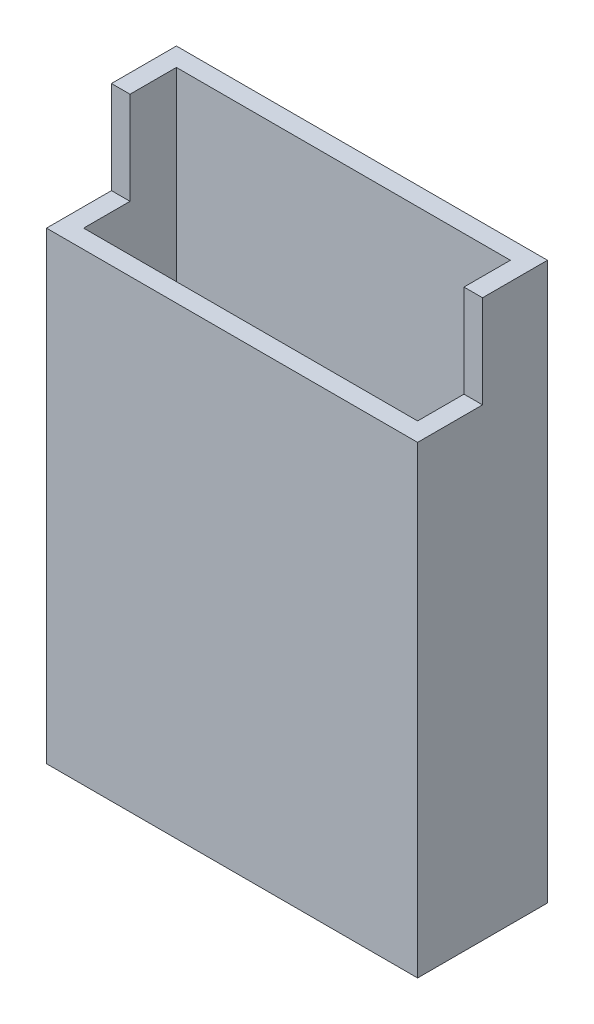
ISO-10303-21;
HEADER;
FILE_DESCRIPTION(('STEP AP214'),'2;1');
FILE_NAME('part.step','',(''),(''),'','','');
FILE_SCHEMA(('AUTOMOTIVE_DESIGN { 1 0 10303 214 1 1 1 1 }'));
ENDSEC;
DATA;
#1=APPLICATION_CONTEXT('core data for automotive mechanical design processes');
#2=APPLICATION_PROTOCOL_DEFINITION('international standard','automotive_design',2000,#1);
#3=PRODUCT_CONTEXT('',#1,'mechanical');
#4=PRODUCT('Part','Part','',(#3));
#5=PRODUCT_RELATED_PRODUCT_CATEGORY('part','',(#4));
#6=PRODUCT_DEFINITION_FORMATION('','',#4);
#7=PRODUCT_DEFINITION_CONTEXT('part definition',#1,'design');
#8=PRODUCT_DEFINITION('design','',#6,#7);
#9=PRODUCT_DEFINITION_SHAPE('','',#8);
#10=(LENGTH_UNIT() NAMED_UNIT(*) SI_UNIT(.MILLI.,.METRE.));
#11=(NAMED_UNIT(*) PLANE_ANGLE_UNIT() SI_UNIT($,.RADIAN.));
#12=(NAMED_UNIT(*) SI_UNIT($,.STERADIAN.) SOLID_ANGLE_UNIT());
#13=UNCERTAINTY_MEASURE_WITH_UNIT(LENGTH_MEASURE(1.E-05),#10,'distance_accuracy_value','');
#14=(GEOMETRIC_REPRESENTATION_CONTEXT(3) GLOBAL_UNCERTAINTY_ASSIGNED_CONTEXT((#13)) GLOBAL_UNIT_ASSIGNED_CONTEXT((#10,
#11,#12)) REPRESENTATION_CONTEXT('',''));
#15=CARTESIAN_POINT('',(0.,0.,0.));
#16=DIRECTION('',(0.,0.,1.));
#17=DIRECTION('',(1.,0.,0.));
#18=AXIS2_PLACEMENT_3D('',#15,#16,#17);
#19=CARTESIAN_POINT('',(0.,60.,0.));
#20=DIRECTION('',(0.,1.,0.));
#21=DIRECTION('',(0.,0.,1.));
#22=AXIS2_PLACEMENT_3D('',#19,#20,#21);
#23=PLANE('',#22);
#24=DIRECTION('',(0.,0.,1.));
#25=VECTOR('',#24,1.);
#26=CARTESIAN_POINT('',(0.,60.,-14.));
#27=LINE('',#26,#25);
#28=CARTESIAN_POINT('',(0.,60.,-14.));
#29=VERTEX_POINT('',#28);
#30=CARTESIAN_POINT('',(0.,60.,-7.));
#31=VERTEX_POINT('',#30);
#32=EDGE_CURVE('E81',#29,#31,#27,.T.);
#33=ORIENTED_EDGE('',*,*,#32,.T.);
#34=DIRECTION('',(-1.,0.,0.));
#35=VECTOR('',#34,1.);
#36=CARTESIAN_POINT('',(0.,60.,-7.));
#37=LINE('',#36,#35);
#38=CARTESIAN_POINT('',(2.,60.,-7.));
#39=VERTEX_POINT('',#38);
#40=EDGE_CURVE('E209',#39,#31,#37,.T.);
#41=ORIENTED_EDGE('',*,*,#40,.F.);
#42=DIRECTION('',(0.,0.,-1.));
#43=VECTOR('',#42,1.);
#44=CARTESIAN_POINT('',(2.,60.,-2.));
#45=LINE('',#44,#43);
#46=CARTESIAN_POINT('',(2.,60.,-12.));
#47=VERTEX_POINT('',#46);
#48=EDGE_CURVE('E177',#39,#47,#45,.T.);
#49=ORIENTED_EDGE('',*,*,#48,.T.);
#50=DIRECTION('',(1.,0.,0.));
#51=VECTOR('',#50,1.);
#52=CARTESIAN_POINT('',(2.,60.,-12.));
#53=LINE('',#52,#51);
#54=CARTESIAN_POINT('',(38.,60.,-12.));
#55=VERTEX_POINT('',#54);
#56=EDGE_CURVE('E189',#47,#55,#53,.T.);
#57=ORIENTED_EDGE('',*,*,#56,.T.);
#58=DIRECTION('',(0.,0.,-1.));
#59=VECTOR('',#58,1.);
#60=CARTESIAN_POINT('',(38.,60.,-2.));
#61=LINE('',#60,#59);
#62=CARTESIAN_POINT('',(38.,60.,-7.));
#63=VERTEX_POINT('',#62);
#64=EDGE_CURVE('E182',#63,#55,#61,.T.);
#65=ORIENTED_EDGE('',*,*,#64,.F.);
#66=CARTESIAN_POINT('',(40.,60.,-7.));
#67=VERTEX_POINT('',#66);
#68=EDGE_CURVE('E167',#67,#63,#37,.T.);
#69=ORIENTED_EDGE('',*,*,#68,.F.);
#70=DIRECTION('',(0.,0.,1.));
#71=VECTOR('',#70,1.);
#72=CARTESIAN_POINT('',(40.,60.,-14.));
#73=LINE('',#72,#71);
#74=CARTESIAN_POINT('',(40.,60.,-14.));
#75=VERTEX_POINT('',#74);
#76=EDGE_CURVE('E100',#75,#67,#73,.T.);
#77=ORIENTED_EDGE('',*,*,#76,.F.);
#78=DIRECTION('',(1.,0.,0.));
#79=VECTOR('',#78,1.);
#80=CARTESIAN_POINT('',(0.,60.,-14.));
#81=LINE('',#80,#79);
#82=EDGE_CURVE('E84',#29,#75,#81,.T.);
#83=ORIENTED_EDGE('',*,*,#82,.F.);
#84=EDGE_LOOP('',(#33,#41,#49,#57,#65,#69,#77,#83));
#85=FACE_BOUND('',#84,.T.);
#86=ADVANCED_FACE('F34',(#85),#23,.T.);
#87=CARTESIAN_POINT('',(0.,60.,-14.));
#88=DIRECTION('',(1.,0.,0.));
#89=DIRECTION('',(0.,0.,-1.));
#90=AXIS2_PLACEMENT_3D('',#87,#88,#89);
#91=PLANE('',#90);
#92=DIRECTION('',(0.,-1.,0.));
#93=VECTOR('',#92,1.);
#94=CARTESIAN_POINT('',(0.,60.,0.));
#95=LINE('',#94,#93);
#96=CARTESIAN_POINT('',(0.,50.,0.));
#97=VERTEX_POINT('',#96);
#98=CARTESIAN_POINT('',(0.,0.,0.));
#99=VERTEX_POINT('',#98);
#100=EDGE_CURVE('E108',#97,#99,#95,.T.);
#101=ORIENTED_EDGE('',*,*,#100,.F.);
#102=DIRECTION('',(0.,0.,1.));
#103=VECTOR('',#102,1.);
#104=CARTESIAN_POINT('',(0.,50.,-7.));
#105=LINE('',#104,#103);
#106=CARTESIAN_POINT('',(0.,50.,-7.));
#107=VERTEX_POINT('',#106);
#108=EDGE_CURVE('E162',#107,#97,#105,.T.);
#109=ORIENTED_EDGE('',*,*,#108,.F.);
#110=DIRECTION('',(0.,-1.,0.));
#111=VECTOR('',#110,1.);
#112=CARTESIAN_POINT('',(0.,60.,-7.));
#113=LINE('',#112,#111);
#114=EDGE_CURVE('E319',#31,#107,#113,.T.);
#115=ORIENTED_EDGE('',*,*,#114,.F.);
#116=ORIENTED_EDGE('',*,*,#32,.F.);
#117=DIRECTION('',(0.,-1.,0.));
#118=VECTOR('',#117,1.);
#119=CARTESIAN_POINT('',(0.,60.,-14.));
#120=LINE('',#119,#118);
#121=CARTESIAN_POINT('',(0.,0.,-14.));
#122=VERTEX_POINT('',#121);
#123=EDGE_CURVE('E58',#29,#122,#120,.T.);
#124=ORIENTED_EDGE('',*,*,#123,.T.);
#125=DIRECTION('',(0.,0.,1.));
#126=VECTOR('',#125,1.);
#127=CARTESIAN_POINT('',(0.,0.,-14.));
#128=LINE('',#127,#126);
#129=EDGE_CURVE('E78',#122,#99,#128,.T.);
#130=ORIENTED_EDGE('',*,*,#129,.T.);
#131=EDGE_LOOP('',(#101,#109,#115,#116,#124,#130));
#132=FACE_BOUND('',#131,.T.);
#133=ADVANCED_FACE('F36',(#132),#91,.F.);
#134=CARTESIAN_POINT('',(0.,60.,0.));
#135=DIRECTION('',(0.,0.,-1.));
#136=DIRECTION('',(-1.,0.,0.));
#137=AXIS2_PLACEMENT_3D('',#134,#135,#136);
#138=PLANE('',#137);
#139=DIRECTION('',(0.,-1.,0.));
#140=VECTOR('',#139,1.);
#141=CARTESIAN_POINT('',(40.,60.,0.));
#142=LINE('',#141,#140);
#143=CARTESIAN_POINT('',(40.,50.,0.));
#144=VERTEX_POINT('',#143);
#145=CARTESIAN_POINT('',(40.,0.,0.));
#146=VERTEX_POINT('',#145);
#147=EDGE_CURVE('E106',#144,#146,#142,.T.);
#148=ORIENTED_EDGE('',*,*,#147,.F.);
#149=DIRECTION('',(1.,0.,0.));
#150=VECTOR('',#149,1.);
#151=CARTESIAN_POINT('',(0.,50.,0.));
#152=LINE('',#151,#150);
#153=EDGE_CURVE('E170',#97,#144,#152,.T.);
#154=ORIENTED_EDGE('',*,*,#153,.F.);
#155=ORIENTED_EDGE('',*,*,#100,.T.);
#156=DIRECTION('',(1.,0.,0.));
#157=VECTOR('',#156,1.);
#158=CARTESIAN_POINT('',(0.,0.,0.));
#159=LINE('',#158,#157);
#160=EDGE_CURVE('E93',#99,#146,#159,.T.);
#161=ORIENTED_EDGE('',*,*,#160,.T.);
#162=EDGE_LOOP('',(#148,#154,#155,#161));
#163=FACE_BOUND('',#162,.T.);
#164=ADVANCED_FACE('F145',(#163),#138,.F.);
#165=CARTESIAN_POINT('',(40.,60.,-14.));
#166=DIRECTION('',(1.,0.,0.));
#167=DIRECTION('',(0.,0.,-1.));
#168=AXIS2_PLACEMENT_3D('',#165,#166,#167);
#169=PLANE('',#168);
#170=DIRECTION('',(0.,0.,1.));
#171=VECTOR('',#170,1.);
#172=CARTESIAN_POINT('',(40.,50.,-7.));
#173=LINE('',#172,#171);
#174=CARTESIAN_POINT('',(40.,50.,-7.));
#175=VERTEX_POINT('',#174);
#176=EDGE_CURVE('E154',#175,#144,#173,.T.);
#177=ORIENTED_EDGE('',*,*,#176,.T.);
#178=ORIENTED_EDGE('',*,*,#147,.T.);
#179=DIRECTION('',(0.,0.,1.));
#180=VECTOR('',#179,1.);
#181=CARTESIAN_POINT('',(40.,0.,-14.));
#182=LINE('',#181,#180);
#183=CARTESIAN_POINT('',(40.,0.,-14.));
#184=VERTEX_POINT('',#183);
#185=EDGE_CURVE('E98',#184,#146,#182,.T.);
#186=ORIENTED_EDGE('',*,*,#185,.F.);
#187=DIRECTION('',(0.,-1.,0.));
#188=VECTOR('',#187,1.);
#189=CARTESIAN_POINT('',(40.,60.,-14.));
#190=LINE('',#189,#188);
#191=EDGE_CURVE('E83',#75,#184,#190,.T.);
#192=ORIENTED_EDGE('',*,*,#191,.F.);
#193=ORIENTED_EDGE('',*,*,#76,.T.);
#194=DIRECTION('',(0.,1.,0.));
#195=VECTOR('',#194,1.);
#196=CARTESIAN_POINT('',(40.,60.,-7.));
#197=LINE('',#196,#195);
#198=EDGE_CURVE('E157',#175,#67,#197,.T.);
#199=ORIENTED_EDGE('',*,*,#198,.F.);
#200=EDGE_LOOP('',(#177,#178,#186,#192,#193,#199));
#201=FACE_BOUND('',#200,.T.);
#202=ADVANCED_FACE('F150',(#201),#169,.T.);
#203=CARTESIAN_POINT('',(0.,60.,-14.));
#204=DIRECTION('',(0.,0.,-1.));
#205=DIRECTION('',(-1.,0.,0.));
#206=AXIS2_PLACEMENT_3D('',#203,#204,#205);
#207=PLANE('',#206);
#208=DIRECTION('',(1.,0.,0.));
#209=VECTOR('',#208,1.);
#210=CARTESIAN_POINT('',(0.,0.,-14.));
#211=LINE('',#210,#209);
#212=EDGE_CURVE('E91',#122,#184,#211,.T.);
#213=ORIENTED_EDGE('',*,*,#212,.F.);
#214=ORIENTED_EDGE('',*,*,#123,.F.);
#215=ORIENTED_EDGE('',*,*,#82,.T.);
#216=ORIENTED_EDGE('',*,*,#191,.T.);
#217=EDGE_LOOP('',(#213,#214,#215,#216));
#218=FACE_BOUND('',#217,.T.);
#219=ADVANCED_FACE('F96',(#218),#207,.T.);
#220=CARTESIAN_POINT('',(0.,0.,0.));
#221=DIRECTION('',(0.,1.,0.));
#222=DIRECTION('',(0.,0.,1.));
#223=AXIS2_PLACEMENT_3D('',#220,#221,#222);
#224=PLANE('',#223);
#225=ORIENTED_EDGE('',*,*,#129,.F.);
#226=ORIENTED_EDGE('',*,*,#212,.T.);
#227=ORIENTED_EDGE('',*,*,#185,.T.);
#228=ORIENTED_EDGE('',*,*,#160,.F.);
#229=EDGE_LOOP('',(#225,#226,#227,#228));
#230=FACE_BOUND('',#229,.T.);
#231=ADVANCED_FACE('F89',(#230),#224,.F.);
#232=CARTESIAN_POINT('',(2.,5.,-2.));
#233=DIRECTION('',(1.,0.,0.));
#234=DIRECTION('',(0.,0.,-1.));
#235=AXIS2_PLACEMENT_3D('',#232,#233,#234);
#236=PLANE('',#235);
#237=DIRECTION('',(0.,0.,-1.));
#238=VECTOR('',#237,1.);
#239=CARTESIAN_POINT('',(2.,50.,-2.));
#240=LINE('',#239,#238);
#241=CARTESIAN_POINT('',(2.,50.,-2.));
#242=VERTEX_POINT('',#241);
#243=CARTESIAN_POINT('',(2.,50.,-7.));
#244=VERTEX_POINT('',#243);
#245=EDGE_CURVE('E164',#242,#244,#240,.T.);
#246=ORIENTED_EDGE('',*,*,#245,.F.);
#247=DIRECTION('',(0.,1.,0.));
#248=VECTOR('',#247,1.);
#249=CARTESIAN_POINT('',(2.,5.,-2.));
#250=LINE('',#249,#248);
#251=CARTESIAN_POINT('',(2.,5.,-2.));
#252=VERTEX_POINT('',#251);
#253=EDGE_CURVE('E120',#252,#242,#250,.T.);
#254=ORIENTED_EDGE('',*,*,#253,.F.);
#255=DIRECTION('',(0.,0.,-1.));
#256=VECTOR('',#255,1.);
#257=CARTESIAN_POINT('',(2.,5.,-2.));
#258=LINE('',#257,#256);
#259=CARTESIAN_POINT('',(2.,5.,-12.));
#260=VERTEX_POINT('',#259);
#261=EDGE_CURVE('E178',#252,#260,#258,.T.);
#262=ORIENTED_EDGE('',*,*,#261,.T.);
#263=DIRECTION('',(0.,1.,0.));
#264=VECTOR('',#263,1.);
#265=CARTESIAN_POINT('',(2.,5.,-12.));
#266=LINE('',#265,#264);
#267=EDGE_CURVE('E94',#260,#47,#266,.T.);
#268=ORIENTED_EDGE('',*,*,#267,.T.);
#269=ORIENTED_EDGE('',*,*,#48,.F.);
#270=DIRECTION('',(0.,-1.,0.));
#271=VECTOR('',#270,1.);
#272=CARTESIAN_POINT('',(2.,5.,-7.));
#273=LINE('',#272,#271);
#274=EDGE_CURVE('E174',#39,#244,#273,.T.);
#275=ORIENTED_EDGE('',*,*,#274,.T.);
#276=EDGE_LOOP('',(#246,#254,#262,#268,#269,#275));
#277=FACE_BOUND('',#276,.T.);
#278=ADVANCED_FACE('F212',(#277),#236,.T.);
#279=CARTESIAN_POINT('',(2.,5.,-12.));
#280=DIRECTION('',(0.,0.,1.));
#281=DIRECTION('',(1.,0.,0.));
#282=AXIS2_PLACEMENT_3D('',#279,#280,#281);
#283=PLANE('',#282);
#284=ORIENTED_EDGE('',*,*,#56,.F.);
#285=ORIENTED_EDGE('',*,*,#267,.F.);
#286=DIRECTION('',(1.,0.,0.));
#287=VECTOR('',#286,1.);
#288=CARTESIAN_POINT('',(2.,5.,-12.));
#289=LINE('',#288,#287);
#290=CARTESIAN_POINT('',(38.,5.,-12.));
#291=VERTEX_POINT('',#290);
#292=EDGE_CURVE('E181',#260,#291,#289,.T.);
#293=ORIENTED_EDGE('',*,*,#292,.T.);
#294=DIRECTION('',(0.,1.,0.));
#295=VECTOR('',#294,1.);
#296=CARTESIAN_POINT('',(38.,5.,-12.));
#297=LINE('',#296,#295);
#298=EDGE_CURVE('E131',#291,#55,#297,.T.);
#299=ORIENTED_EDGE('',*,*,#298,.T.);
#300=EDGE_LOOP('',(#284,#285,#293,#299));
#301=FACE_BOUND('',#300,.T.);
#302=ADVANCED_FACE('F202',(#301),#283,.T.);
#303=CARTESIAN_POINT('',(38.,5.,-2.));
#304=DIRECTION('',(1.,0.,0.));
#305=DIRECTION('',(0.,0.,-1.));
#306=AXIS2_PLACEMENT_3D('',#303,#304,#305);
#307=PLANE('',#306);
#308=DIRECTION('',(0.,1.,0.));
#309=VECTOR('',#308,1.);
#310=CARTESIAN_POINT('',(38.,5.,-2.));
#311=LINE('',#310,#309);
#312=CARTESIAN_POINT('',(38.,5.,-2.));
#313=VERTEX_POINT('',#312);
#314=CARTESIAN_POINT('',(38.,50.,-2.));
#315=VERTEX_POINT('',#314);
#316=EDGE_CURVE('E116',#313,#315,#311,.T.);
#317=ORIENTED_EDGE('',*,*,#316,.T.);
#318=DIRECTION('',(0.,0.,-1.));
#319=VECTOR('',#318,1.);
#320=CARTESIAN_POINT('',(38.,50.,-2.));
#321=LINE('',#320,#319);
#322=CARTESIAN_POINT('',(38.,50.,-7.));
#323=VERTEX_POINT('',#322);
#324=EDGE_CURVE('E49',#315,#323,#321,.T.);
#325=ORIENTED_EDGE('',*,*,#324,.T.);
#326=DIRECTION('',(0.,-1.,0.));
#327=VECTOR('',#326,1.);
#328=CARTESIAN_POINT('',(38.,5.,-7.));
#329=LINE('',#328,#327);
#330=EDGE_CURVE('E11',#63,#323,#329,.T.);
#331=ORIENTED_EDGE('',*,*,#330,.F.);
#332=ORIENTED_EDGE('',*,*,#64,.T.);
#333=ORIENTED_EDGE('',*,*,#298,.F.);
#334=DIRECTION('',(0.,0.,-1.));
#335=VECTOR('',#334,1.);
#336=CARTESIAN_POINT('',(38.,5.,-2.));
#337=LINE('',#336,#335);
#338=EDGE_CURVE('E129',#313,#291,#337,.T.);
#339=ORIENTED_EDGE('',*,*,#338,.F.);
#340=EDGE_LOOP('',(#317,#325,#331,#332,#333,#339));
#341=FACE_BOUND('',#340,.T.);
#342=ADVANCED_FACE('F124',(#341),#307,.F.);
#343=CARTESIAN_POINT('',(2.,5.,-2.));
#344=DIRECTION('',(0.,0.,1.));
#345=DIRECTION('',(1.,0.,0.));
#346=AXIS2_PLACEMENT_3D('',#343,#344,#345);
#347=PLANE('',#346);
#348=ORIENTED_EDGE('',*,*,#253,.T.);
#349=DIRECTION('',(1.,0.,0.));
#350=VECTOR('',#349,1.);
#351=CARTESIAN_POINT('',(2.,50.,-2.));
#352=LINE('',#351,#350);
#353=EDGE_CURVE('E42',#242,#315,#352,.T.);
#354=ORIENTED_EDGE('',*,*,#353,.T.);
#355=ORIENTED_EDGE('',*,*,#316,.F.);
#356=DIRECTION('',(1.,0.,0.));
#357=VECTOR('',#356,1.);
#358=CARTESIAN_POINT('',(2.,5.,-2.));
#359=LINE('',#358,#357);
#360=EDGE_CURVE('E135',#252,#313,#359,.T.);
#361=ORIENTED_EDGE('',*,*,#360,.F.);
#362=EDGE_LOOP('',(#348,#354,#355,#361));
#363=FACE_BOUND('',#362,.T.);
#364=ADVANCED_FACE('F113',(#363),#347,.F.);
#365=CARTESIAN_POINT('',(0.,5.,0.));
#366=DIRECTION('',(0.,-1.,0.));
#367=DIRECTION('',(0.,0.,-1.));
#368=AXIS2_PLACEMENT_3D('',#365,#366,#367);
#369=PLANE('',#368);
#370=ORIENTED_EDGE('',*,*,#261,.F.);
#371=ORIENTED_EDGE('',*,*,#360,.T.);
#372=ORIENTED_EDGE('',*,*,#338,.T.);
#373=ORIENTED_EDGE('',*,*,#292,.F.);
#374=EDGE_LOOP('',(#370,#371,#372,#373));
#375=FACE_BOUND('',#374,.T.);
#376=ADVANCED_FACE('F227',(#375),#369,.F.);
#377=CARTESIAN_POINT('',(0.,0.,-7.));
#378=DIRECTION('',(0.,0.,1.));
#379=DIRECTION('',(1.,0.,0.));
#380=AXIS2_PLACEMENT_3D('',#377,#378,#379);
#381=PLANE('',#380);
#382=ORIENTED_EDGE('',*,*,#330,.T.);
#383=DIRECTION('',(1.,0.,0.));
#384=VECTOR('',#383,1.);
#385=CARTESIAN_POINT('',(0.,50.,-7.));
#386=LINE('',#385,#384);
#387=EDGE_CURVE('E323',#323,#175,#386,.T.);
#388=ORIENTED_EDGE('',*,*,#387,.T.);
#389=ORIENTED_EDGE('',*,*,#198,.T.);
#390=ORIENTED_EDGE('',*,*,#68,.T.);
#391=EDGE_LOOP('',(#382,#388,#389,#390));
#392=FACE_BOUND('',#391,.T.);
#393=ADVANCED_FACE('F229',(#392),#381,.T.);
#394=CARTESIAN_POINT('',(0.,50.,-7.));
#395=DIRECTION('',(0.,-1.,0.));
#396=DIRECTION('',(0.,0.,-1.));
#397=AXIS2_PLACEMENT_3D('',#394,#395,#396);
#398=PLANE('',#397);
#399=ORIENTED_EDGE('',*,*,#245,.T.);
#400=EDGE_CURVE('E332',#107,#244,#386,.T.);
#401=ORIENTED_EDGE('',*,*,#400,.F.);
#402=ORIENTED_EDGE('',*,*,#108,.T.);
#403=ORIENTED_EDGE('',*,*,#153,.T.);
#404=ORIENTED_EDGE('',*,*,#176,.F.);
#405=ORIENTED_EDGE('',*,*,#387,.F.);
#406=ORIENTED_EDGE('',*,*,#324,.F.);
#407=ORIENTED_EDGE('',*,*,#353,.F.);
#408=EDGE_LOOP('',(#399,#401,#402,#403,#404,#405,#406,#407));
#409=FACE_BOUND('',#408,.T.);
#410=ADVANCED_FACE('F235',(#409),#398,.F.);
#411=ORIENTED_EDGE('',*,*,#40,.T.);
#412=ORIENTED_EDGE('',*,*,#114,.T.);
#413=ORIENTED_EDGE('',*,*,#400,.T.);
#414=ORIENTED_EDGE('',*,*,#274,.F.);
#415=EDGE_LOOP('',(#411,#412,#413,#414));
#416=FACE_BOUND('',#415,.T.);
#417=ADVANCED_FACE('F238',(#416),#381,.T.);
#418=CLOSED_SHELL('',(#86,#133,#164,#202,#219,#231,#278,#302,#342,#364,#376,#393,#410,#417));
#419=MANIFOLD_SOLID_BREP('B2',#418);
#420=ADVANCED_BREP_SHAPE_REPRESENTATION('',(#18,#419),#14);
#421=SHAPE_DEFINITION_REPRESENTATION(#9,#420);
ENDSEC;
END-ISO-10303-21;
